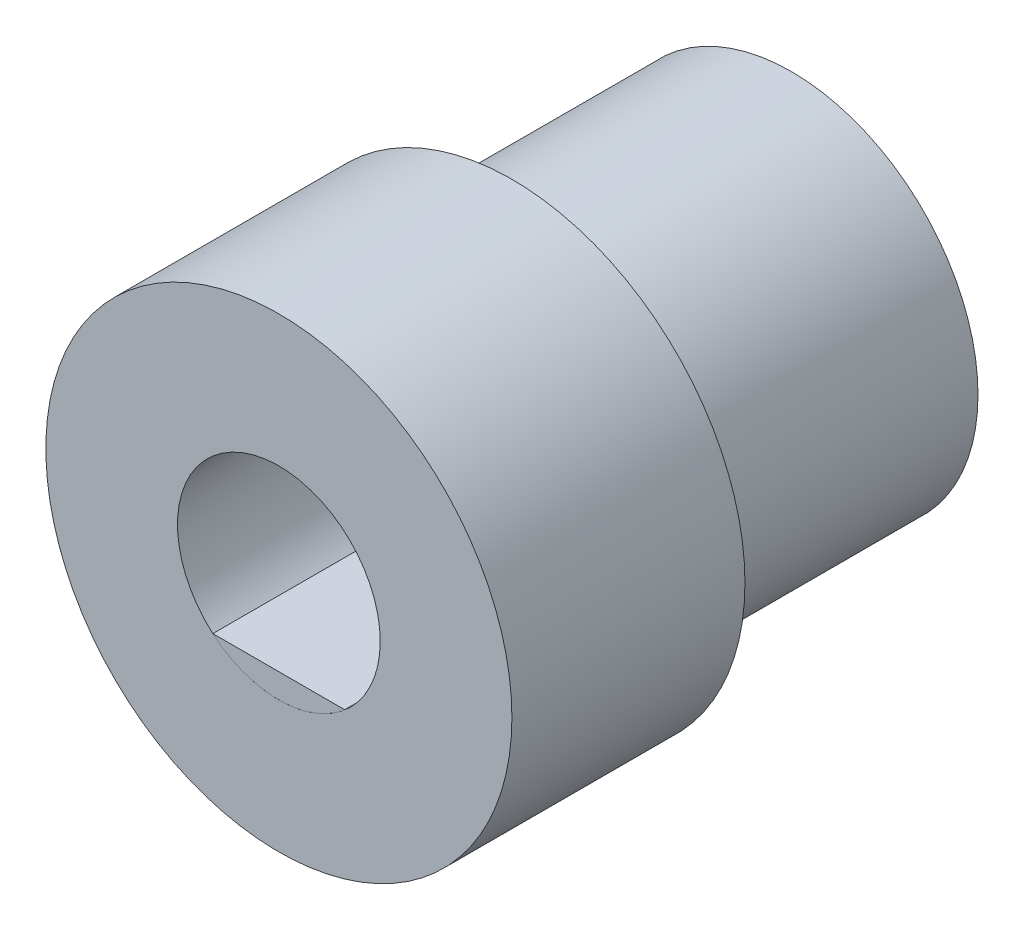
ISO-10303-21;
HEADER;
FILE_DESCRIPTION(('STEP AP214'),'2;1');
FILE_NAME('part.step','',(''),(''),'','','');
FILE_SCHEMA(('AUTOMOTIVE_DESIGN { 1 0 10303 214 1 1 1 1 }'));
ENDSEC;
DATA;
#1=APPLICATION_CONTEXT('core data for automotive mechanical design processes');
#2=APPLICATION_PROTOCOL_DEFINITION('international standard','automotive_design',2000,#1);
#3=PRODUCT_CONTEXT('',#1,'mechanical');
#4=PRODUCT('Part','Part','',(#3));
#5=PRODUCT_RELATED_PRODUCT_CATEGORY('part','',(#4));
#6=PRODUCT_DEFINITION_FORMATION('','',#4);
#7=PRODUCT_DEFINITION_CONTEXT('part definition',#1,'design');
#8=PRODUCT_DEFINITION('design','',#6,#7);
#9=PRODUCT_DEFINITION_SHAPE('','',#8);
#10=(LENGTH_UNIT() NAMED_UNIT(*) SI_UNIT(.MILLI.,.METRE.));
#11=(NAMED_UNIT(*) PLANE_ANGLE_UNIT() SI_UNIT($,.RADIAN.));
#12=(NAMED_UNIT(*) SI_UNIT($,.STERADIAN.) SOLID_ANGLE_UNIT());
#13=UNCERTAINTY_MEASURE_WITH_UNIT(LENGTH_MEASURE(1.E-05),#10,'distance_accuracy_value','');
#14=(GEOMETRIC_REPRESENTATION_CONTEXT(3) GLOBAL_UNCERTAINTY_ASSIGNED_CONTEXT((#13)) GLOBAL_UNIT_ASSIGNED_CONTEXT((#10,
#11,#12)) REPRESENTATION_CONTEXT('',''));
#15=CARTESIAN_POINT('',(0.,0.,0.));
#16=DIRECTION('',(0.,0.,1.));
#17=DIRECTION('',(1.,0.,0.));
#18=AXIS2_PLACEMENT_3D('',#15,#16,#17);
#19=CARTESIAN_POINT('',(0.,0.,0.));
#20=DIRECTION('',(0.,0.,-1.));
#21=DIRECTION('',(-1.,0.,0.));
#22=AXIS2_PLACEMENT_3D('',#19,#20,#21);
#23=PLANE('',#22);
#24=DIRECTION('',(-1.,0.,0.));
#25=VECTOR('',#24,1.);
#26=CARTESIAN_POINT('',(-2.83416654415368,-3.3,0.));
#27=LINE('',#26,#25);
#28=CARTESIAN_POINT('',(2.83416654415368,-3.3,-1.13686837721616E-10));
#29=VERTEX_POINT('',#28);
#30=CARTESIAN_POINT('',(-2.83416654415368,-3.3,-1.13686837721616E-10));
#31=VERTEX_POINT('',#30);
#32=EDGE_CURVE('E74',#29,#31,#27,.T.);
#33=ORIENTED_EDGE('',*,*,#32,.F.);
#34=CARTESIAN_POINT('',(0.,0.,0.));
#35=DIRECTION('',(0.,0.,-1.));
#36=DIRECTION('',(-1.,0.,0.));
#37=AXIS2_PLACEMENT_3D('',#34,#35,#36);
#38=CIRCLE('',#37,4.35);
#39=EDGE_CURVE('E73',#31,#29,#38,.F.);
#40=ORIENTED_EDGE('',*,*,#39,.F.);
#41=EDGE_LOOP('',(#33,#40));
#42=FACE_BOUND('',#41,.T.);
#43=ADVANCED_FACE('F42',(#42),#23,.T.);
#44=CARTESIAN_POINT('',(0.,0.,-500000.));
#45=DIRECTION('',(0.,0.,1.));
#46=DIRECTION('',(1.,0.,0.));
#47=AXIS2_PLACEMENT_3D('',#44,#45,#46);
#48=CYLINDRICAL_SURFACE('',#47,4.35);
#49=DIRECTION('',(0.,0.,1.));
#50=VECTOR('',#49,1.);
#51=CARTESIAN_POINT('',(-2.83416654415368,-3.3,-500000.));
#52=LINE('',#51,#50);
#53=CARTESIAN_POINT('',(-2.83416654415368,-3.3,10.));
#54=VERTEX_POINT('',#53);
#55=EDGE_CURVE('E46',#31,#54,#52,.T.);
#56=ORIENTED_EDGE('',*,*,#55,.F.);
#57=ORIENTED_EDGE('',*,*,#39,.T.);
#58=DIRECTION('',(0.,0.,1.));
#59=VECTOR('',#58,1.);
#60=CARTESIAN_POINT('',(2.83416654415368,-3.3,-500000.));
#61=LINE('',#60,#59);
#62=CARTESIAN_POINT('',(2.83416654415368,-3.3,10.));
#63=VERTEX_POINT('',#62);
#64=EDGE_CURVE('E66',#29,#63,#61,.T.);
#65=ORIENTED_EDGE('',*,*,#64,.T.);
#66=CARTESIAN_POINT('',(0.,0.,10.));
#67=DIRECTION('',(0.,0.,1.));
#68=DIRECTION('',(1.,0.,0.));
#69=AXIS2_PLACEMENT_3D('',#66,#67,#68);
#70=CIRCLE('',#69,4.35);
#71=EDGE_CURVE('E12',#54,#63,#70,.T.);
#72=ORIENTED_EDGE('',*,*,#71,.F.);
#73=EDGE_LOOP('',(#56,#57,#65,#72));
#74=FACE_BOUND('',#73,.T.);
#75=ADVANCED_FACE('F77',(#74),#48,.T.);
#76=CARTESIAN_POINT('',(-2.83416654415368,-3.3,-500000.));
#77=DIRECTION('',(0.,1.,0.));
#78=DIRECTION('',(0.,0.,1.));
#79=AXIS2_PLACEMENT_3D('',#76,#77,#78);
#80=PLANE('',#79);
#81=ORIENTED_EDGE('',*,*,#64,.F.);
#82=ORIENTED_EDGE('',*,*,#32,.T.);
#83=ORIENTED_EDGE('',*,*,#55,.T.);
#84=DIRECTION('',(-1.,0.,0.));
#85=VECTOR('',#84,1.);
#86=CARTESIAN_POINT('',(-2.83416654415368,-3.3,10.));
#87=LINE('',#86,#85);
#88=EDGE_CURVE('E51',#63,#54,#87,.T.);
#89=ORIENTED_EDGE('',*,*,#88,.F.);
#90=EDGE_LOOP('',(#81,#82,#83,#89));
#91=FACE_BOUND('',#90,.T.);
#92=ADVANCED_FACE('F44',(#91),#80,.T.);
#93=CARTESIAN_POINT('',(0.,0.,10.));
#94=DIRECTION('',(0.,0.,1.));
#95=DIRECTION('',(1.,0.,0.));
#96=AXIS2_PLACEMENT_3D('',#93,#94,#95);
#97=PLANE('',#96);
#98=ORIENTED_EDGE('',*,*,#71,.T.);
#99=ORIENTED_EDGE('',*,*,#88,.T.);
#100=EDGE_LOOP('',(#98,#99));
#101=FACE_BOUND('',#100,.T.);
#102=ADVANCED_FACE('F80',(#101),#97,.T.);
#103=CLOSED_SHELL('',(#43,#75,#92,#102));
#104=MANIFOLD_SOLID_BREP('B2',#103);
#105=CARTESIAN_POINT('',(0.,0.,0.));
#106=DIRECTION('',(0.,0.,1.));
#107=DIRECTION('',(1.,0.,0.));
#108=AXIS2_PLACEMENT_3D('',#105,#106,#107);
#109=PLANE('',#108);
#110=CARTESIAN_POINT('',(0.,0.,0.));
#111=DIRECTION('',(0.,0.,1.));
#112=DIRECTION('',(1.,0.,0.));
#113=AXIS2_PLACEMENT_3D('',#110,#111,#112);
#114=CIRCLE('',#113,10.);
#115=CARTESIAN_POINT('',(10.,0.,0.));
#116=VERTEX_POINT('',#115);
#117=EDGE_CURVE('E167',#116,#116,#114,.T.);
#118=ORIENTED_EDGE('',*,*,#117,.F.);
#119=EDGE_LOOP('',(#118));
#120=FACE_BOUND('',#119,.T.);
#121=CARTESIAN_POINT('',(0.,0.,0.));
#122=DIRECTION('',(0.,0.,1.));
#123=DIRECTION('',(1.,0.,0.));
#124=AXIS2_PLACEMENT_3D('',#121,#122,#123);
#125=CIRCLE('',#124,8.);
#126=CARTESIAN_POINT('',(8.,0.,0.));
#127=VERTEX_POINT('',#126);
#128=EDGE_CURVE('E40',#127,#127,#125,.F.);
#129=ORIENTED_EDGE('',*,*,#128,.F.);
#130=EDGE_LOOP('',(#129));
#131=FACE_BOUND('',#130,.T.);
#132=ADVANCED_FACE('F113',(#120,#131),#109,.F.);
#133=CARTESIAN_POINT('',(0.,0.,10.));
#134=DIRECTION('',(0.,0.,-1.));
#135=DIRECTION('',(-1.,0.,0.));
#136=AXIS2_PLACEMENT_3D('',#133,#134,#135);
#137=CYLINDRICAL_SURFACE('',#136,10.);
#138=CARTESIAN_POINT('',(0.,0.,10.));
#139=DIRECTION('',(0.,0.,1.));
#140=DIRECTION('',(1.,0.,0.));
#141=AXIS2_PLACEMENT_3D('',#138,#139,#140);
#142=CIRCLE('',#141,10.);
#143=CARTESIAN_POINT('',(10.,0.,10.));
#144=VERTEX_POINT('',#143);
#145=EDGE_CURVE('E121',#144,#144,#142,.T.);
#146=ORIENTED_EDGE('',*,*,#145,.F.);
#147=EDGE_LOOP('',(#146));
#148=FACE_BOUND('',#147,.T.);
#149=ORIENTED_EDGE('',*,*,#117,.T.);
#150=EDGE_LOOP('',(#149));
#151=FACE_BOUND('',#150,.T.);
#152=ADVANCED_FACE('F115',(#148,#151),#137,.T.);
#153=CARTESIAN_POINT('',(0.,0.,10.));
#154=DIRECTION('',(0.,0.,1.));
#155=DIRECTION('',(1.,0.,0.));
#156=AXIS2_PLACEMENT_3D('',#153,#154,#155);
#157=PLANE('',#156);
#158=CARTESIAN_POINT('',(0.,0.,10.));
#159=DIRECTION('',(0.,0.,1.));
#160=DIRECTION('',(1.,0.,0.));
#161=AXIS2_PLACEMENT_3D('',#158,#159,#160);
#162=CIRCLE('',#161,4.35);
#163=CARTESIAN_POINT('',(4.35,0.,10.));
#164=VERTEX_POINT('',#163);
#165=EDGE_CURVE('E164',#164,#164,#162,.T.);
#166=ORIENTED_EDGE('',*,*,#165,.F.);
#167=EDGE_LOOP('',(#166));
#168=FACE_BOUND('',#167,.T.);
#169=ORIENTED_EDGE('',*,*,#145,.T.);
#170=EDGE_LOOP('',(#169));
#171=FACE_BOUND('',#170,.T.);
#172=ADVANCED_FACE('F194',(#168,#171),#157,.T.);
#173=CARTESIAN_POINT('',(0.,0.,-12.001));
#174=DIRECTION('',(0.,0.,1.));
#175=DIRECTION('',(1.,0.,0.));
#176=AXIS2_PLACEMENT_3D('',#173,#174,#175);
#177=CYLINDRICAL_SURFACE('',#176,4.35);
#178=ORIENTED_EDGE('',*,*,#165,.T.);
#179=EDGE_LOOP('',(#178));
#180=FACE_BOUND('',#179,.T.);
#181=CARTESIAN_POINT('',(0.,0.,0.));
#182=DIRECTION('',(0.,0.,-1.));
#183=DIRECTION('',(-1.,0.,0.));
#184=AXIS2_PLACEMENT_3D('',#181,#182,#183);
#185=CIRCLE('',#184,4.35);
#186=CARTESIAN_POINT('',(-4.35,0.,0.));
#187=VERTEX_POINT('',#186);
#188=EDGE_CURVE('E157',#187,#187,#185,.F.);
#189=ORIENTED_EDGE('',*,*,#188,.F.);
#190=EDGE_LOOP('',(#189));
#191=FACE_BOUND('',#190,.T.);
#192=ADVANCED_FACE('F188',(#180,#191),#177,.F.);
#193=CARTESIAN_POINT('',(0.,0.,0.));
#194=DIRECTION('',(0.,0.,-1.));
#195=DIRECTION('',(-1.,0.,0.));
#196=AXIS2_PLACEMENT_3D('',#193,#194,#195);
#197=PLANE('',#196);
#198=CARTESIAN_POINT('',(0.,0.,0.));
#199=DIRECTION('',(0.,0.,-1.));
#200=DIRECTION('',(-1.,0.,0.));
#201=AXIS2_PLACEMENT_3D('',#198,#199,#200);
#202=CIRCLE('',#201,2.35);
#203=CARTESIAN_POINT('',(2.02051973511768,-1.2,0.));
#204=VERTEX_POINT('',#203);
#205=CARTESIAN_POINT('',(-2.02051973511768,-1.2,0.));
#206=VERTEX_POINT('',#205);
#207=EDGE_CURVE('E148',#204,#206,#202,.F.);
#208=ORIENTED_EDGE('',*,*,#207,.F.);
#209=DIRECTION('',(1.,0.,0.));
#210=VECTOR('',#209,1.);
#211=CARTESIAN_POINT('',(2.02051973511768,-1.2,0.));
#212=LINE('',#211,#210);
#213=EDGE_CURVE('E138',#206,#204,#212,.T.);
#214=ORIENTED_EDGE('',*,*,#213,.F.);
#215=EDGE_LOOP('',(#208,#214));
#216=FACE_BOUND('',#215,.T.);
#217=ORIENTED_EDGE('',*,*,#188,.T.);
#218=EDGE_LOOP('',(#217));
#219=FACE_BOUND('',#218,.T.);
#220=ADVANCED_FACE('F152',(#216,#219),#197,.F.);
#221=CARTESIAN_POINT('',(0.,0.,-12.));
#222=DIRECTION('',(0.,0.,1.));
#223=DIRECTION('',(1.,0.,0.));
#224=AXIS2_PLACEMENT_3D('',#221,#222,#223);
#225=CYLINDRICAL_SURFACE('',#224,8.);
#226=CARTESIAN_POINT('',(0.,0.,-12.));
#227=DIRECTION('',(0.,0.,-1.));
#228=DIRECTION('',(-1.,0.,0.));
#229=AXIS2_PLACEMENT_3D('',#226,#227,#228);
#230=CIRCLE('',#229,8.);
#231=CARTESIAN_POINT('',(-8.,0.,-12.));
#232=VERTEX_POINT('',#231);
#233=EDGE_CURVE('E154',#232,#232,#230,.T.);
#234=ORIENTED_EDGE('',*,*,#233,.F.);
#235=EDGE_LOOP('',(#234));
#236=FACE_BOUND('',#235,.T.);
#237=ORIENTED_EDGE('',*,*,#128,.T.);
#238=EDGE_LOOP('',(#237));
#239=FACE_BOUND('',#238,.T.);
#240=ADVANCED_FACE('F177',(#236,#239),#225,.T.);
#241=CARTESIAN_POINT('',(0.,0.,-12.));
#242=DIRECTION('',(0.,0.,-1.));
#243=DIRECTION('',(-1.,0.,0.));
#244=AXIS2_PLACEMENT_3D('',#241,#242,#243);
#245=PLANE('',#244);
#246=CARTESIAN_POINT('',(0.,0.,-12.));
#247=DIRECTION('',(0.,0.,-1.));
#248=DIRECTION('',(-1.,0.,0.));
#249=AXIS2_PLACEMENT_3D('',#246,#247,#248);
#250=CIRCLE('',#249,2.35);
#251=CARTESIAN_POINT('',(-2.02051973511768,-1.2,-12.));
#252=VERTEX_POINT('',#251);
#253=CARTESIAN_POINT('',(2.02051973511768,-1.2,-12.));
#254=VERTEX_POINT('',#253);
#255=EDGE_CURVE('E150',#252,#254,#250,.T.);
#256=ORIENTED_EDGE('',*,*,#255,.F.);
#257=DIRECTION('',(1.,0.,0.));
#258=VECTOR('',#257,1.);
#259=CARTESIAN_POINT('',(2.02051973511768,-1.2,-12.));
#260=LINE('',#259,#258);
#261=EDGE_CURVE('E128',#252,#254,#260,.T.);
#262=ORIENTED_EDGE('',*,*,#261,.T.);
#263=EDGE_LOOP('',(#256,#262));
#264=FACE_BOUND('',#263,.T.);
#265=ORIENTED_EDGE('',*,*,#233,.T.);
#266=EDGE_LOOP('',(#265));
#267=FACE_BOUND('',#266,.T.);
#268=ADVANCED_FACE('F179',(#264,#267),#245,.T.);
#269=CARTESIAN_POINT('',(0.,0.,10.001));
#270=DIRECTION('',(0.,0.,-1.));
#271=DIRECTION('',(-1.,0.,0.));
#272=AXIS2_PLACEMENT_3D('',#269,#270,#271);
#273=CYLINDRICAL_SURFACE('',#272,2.35);
#274=ORIENTED_EDGE('',*,*,#255,.T.);
#275=DIRECTION('',(0.,0.,-1.));
#276=VECTOR('',#275,1.);
#277=CARTESIAN_POINT('',(2.02051973511768,-1.2,4.20148783170914));
#278=LINE('',#277,#276);
#279=EDGE_CURVE('E134',#204,#254,#278,.T.);
#280=ORIENTED_EDGE('',*,*,#279,.F.);
#281=ORIENTED_EDGE('',*,*,#207,.T.);
#282=DIRECTION('',(0.,0.,-1.));
#283=VECTOR('',#282,1.);
#284=CARTESIAN_POINT('',(-2.02051973511768,-1.2,4.20148783170914));
#285=LINE('',#284,#283);
#286=EDGE_CURVE('E140',#206,#252,#285,.T.);
#287=ORIENTED_EDGE('',*,*,#286,.T.);
#288=EDGE_LOOP('',(#274,#280,#281,#287));
#289=FACE_BOUND('',#288,.T.);
#290=ADVANCED_FACE('F147',(#289),#273,.F.);
#291=CARTESIAN_POINT('',(2.02051973511768,-1.2,4.20148783170914));
#292=DIRECTION('',(0.,1.,0.));
#293=DIRECTION('',(0.,0.,1.));
#294=AXIS2_PLACEMENT_3D('',#291,#292,#293);
#295=PLANE('',#294);
#296=ORIENTED_EDGE('',*,*,#286,.F.);
#297=ORIENTED_EDGE('',*,*,#213,.T.);
#298=ORIENTED_EDGE('',*,*,#279,.T.);
#299=ORIENTED_EDGE('',*,*,#261,.F.);
#300=EDGE_LOOP('',(#296,#297,#298,#299));
#301=FACE_BOUND('',#300,.T.);
#302=ADVANCED_FACE('F139',(#301),#295,.T.);
#303=CLOSED_SHELL('',(#132,#152,#172,#192,#220,#240,#268,#290,#302));
#304=MANIFOLD_SOLID_BREP('B6',#303);
#305=ADVANCED_BREP_SHAPE_REPRESENTATION('',(#18,#104,#304),#14);
#306=SHAPE_DEFINITION_REPRESENTATION(#9,#305);
ENDSEC;
END-ISO-10303-21;
